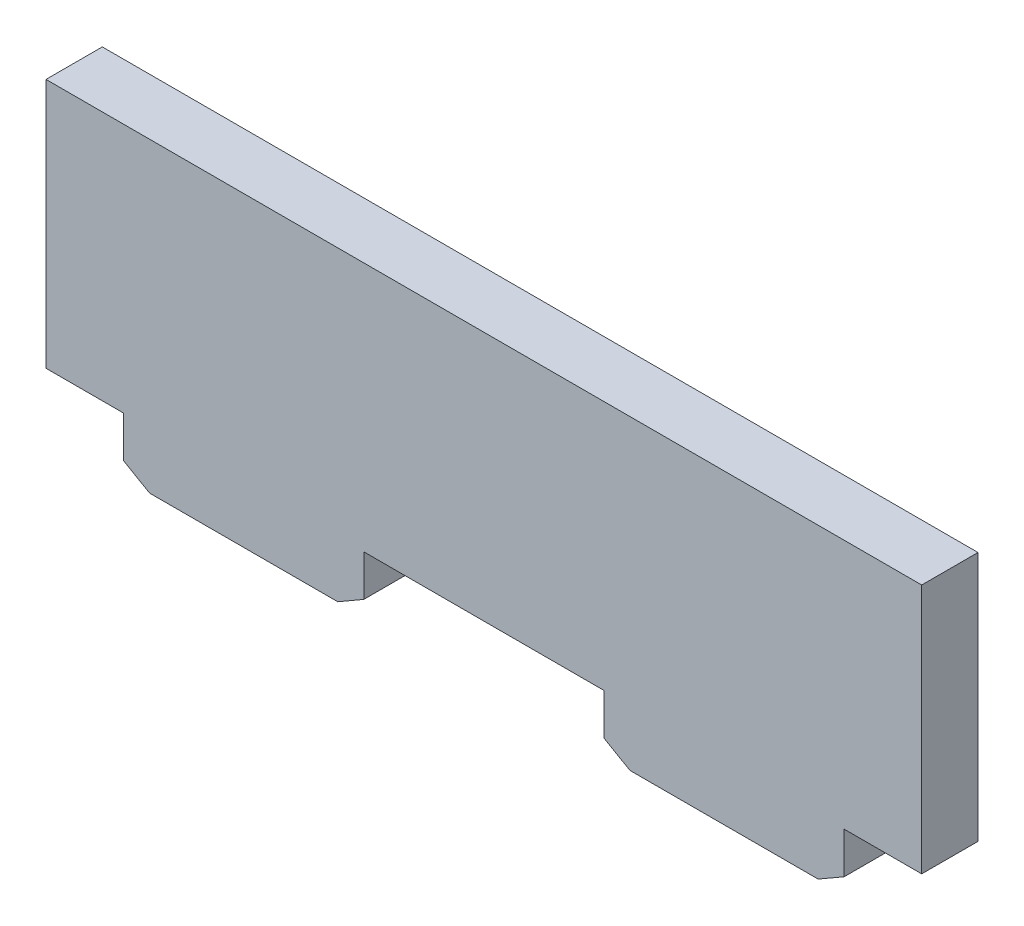
ISO-10303-21;
HEADER;
FILE_DESCRIPTION(('STEP AP214'),'2;1');
FILE_NAME('part.step','',(''),(''),'','','');
FILE_SCHEMA(('AUTOMOTIVE_DESIGN { 1 0 10303 214 1 1 1 1 }'));
ENDSEC;
DATA;
#1=APPLICATION_CONTEXT('core data for automotive mechanical design processes');
#2=APPLICATION_PROTOCOL_DEFINITION('international standard','automotive_design',2000,#1);
#3=PRODUCT_CONTEXT('',#1,'mechanical');
#4=PRODUCT('Part','Part','',(#3));
#5=PRODUCT_RELATED_PRODUCT_CATEGORY('part','',(#4));
#6=PRODUCT_DEFINITION_FORMATION('','',#4);
#7=PRODUCT_DEFINITION_CONTEXT('part definition',#1,'design');
#8=PRODUCT_DEFINITION('design','',#6,#7);
#9=PRODUCT_DEFINITION_SHAPE('','',#8);
#10=(LENGTH_UNIT() NAMED_UNIT(*) SI_UNIT(.MILLI.,.METRE.));
#11=(NAMED_UNIT(*) PLANE_ANGLE_UNIT() SI_UNIT($,.RADIAN.));
#12=(NAMED_UNIT(*) SI_UNIT($,.STERADIAN.) SOLID_ANGLE_UNIT());
#13=UNCERTAINTY_MEASURE_WITH_UNIT(LENGTH_MEASURE(1.E-05),#10,'distance_accuracy_value','');
#14=(GEOMETRIC_REPRESENTATION_CONTEXT(3) GLOBAL_UNCERTAINTY_ASSIGNED_CONTEXT((#13)) GLOBAL_UNIT_ASSIGNED_CONTEXT((#10,
#11,#12)) REPRESENTATION_CONTEXT('',''));
#15=CARTESIAN_POINT('',(0.,0.,0.));
#16=DIRECTION('',(0.,0.,1.));
#17=DIRECTION('',(1.,0.,0.));
#18=AXIS2_PLACEMENT_3D('',#15,#16,#17);
#19=CARTESIAN_POINT('',(-22.225,-6.35,2.8575));
#20=DIRECTION('',(0.,1.,0.));
#21=DIRECTION('',(0.,0.,1.));
#22=AXIS2_PLACEMENT_3D('',#19,#20,#21);
#23=PLANE('',#22);
#24=DIRECTION('',(0.,0.,1.));
#25=VECTOR('',#24,1.);
#26=CARTESIAN_POINT('',(18.288,-6.35,2.8575));
#27=LINE('',#26,#25);
#28=CARTESIAN_POINT('',(18.288,-6.35,0.));
#29=VERTEX_POINT('',#28);
#30=CARTESIAN_POINT('',(18.288,-6.35,2.8575));
#31=VERTEX_POINT('',#30);
#32=EDGE_CURVE('E161',#29,#31,#27,.T.);
#33=ORIENTED_EDGE('',*,*,#32,.F.);
#34=DIRECTION('',(1.,0.,0.));
#35=VECTOR('',#34,1.);
#36=CARTESIAN_POINT('',(-22.225,-6.35,0.));
#37=LINE('',#36,#35);
#38=CARTESIAN_POINT('',(22.225,-6.35,0.));
#39=VERTEX_POINT('',#38);
#40=EDGE_CURVE('E170',#29,#39,#37,.T.);
#41=ORIENTED_EDGE('',*,*,#40,.T.);
#42=DIRECTION('',(0.,0.,-1.));
#43=VECTOR('',#42,1.);
#44=CARTESIAN_POINT('',(22.225,-6.35,2.8575));
#45=LINE('',#44,#43);
#46=CARTESIAN_POINT('',(22.225,-6.35,2.8575));
#47=VERTEX_POINT('',#46);
#48=EDGE_CURVE('E242',#47,#39,#45,.T.);
#49=ORIENTED_EDGE('',*,*,#48,.F.);
#50=DIRECTION('',(1.,0.,0.));
#51=VECTOR('',#50,1.);
#52=CARTESIAN_POINT('',(-22.225,-6.35,2.8575));
#53=LINE('',#52,#51);
#54=EDGE_CURVE('E183',#31,#47,#53,.T.);
#55=ORIENTED_EDGE('',*,*,#54,.F.);
#56=EDGE_LOOP('',(#33,#41,#49,#55));
#57=FACE_BOUND('',#56,.T.);
#58=ADVANCED_FACE('F41',(#57),#23,.F.);
#59=DIRECTION('',(0.,0.,-1.));
#60=VECTOR('',#59,1.);
#61=CARTESIAN_POINT('',(6.096,-6.35,2.8575));
#62=LINE('',#61,#60);
#63=CARTESIAN_POINT('',(6.096,-6.35,2.8575));
#64=VERTEX_POINT('',#63);
#65=CARTESIAN_POINT('',(6.096,-6.35,0.));
#66=VERTEX_POINT('',#65);
#67=EDGE_CURVE('E185',#64,#66,#62,.T.);
#68=ORIENTED_EDGE('',*,*,#67,.F.);
#69=CARTESIAN_POINT('',(-6.096,-6.35,2.8575));
#70=VERTEX_POINT('',#69);
#71=EDGE_CURVE('E243',#70,#64,#53,.T.);
#72=ORIENTED_EDGE('',*,*,#71,.F.);
#73=DIRECTION('',(0.,0.,1.));
#74=VECTOR('',#73,1.);
#75=CARTESIAN_POINT('',(-6.096,-6.35,2.8575));
#76=LINE('',#75,#74);
#77=CARTESIAN_POINT('',(-6.096,-6.35,0.));
#78=VERTEX_POINT('',#77);
#79=EDGE_CURVE('E202',#78,#70,#76,.T.);
#80=ORIENTED_EDGE('',*,*,#79,.F.);
#81=EDGE_CURVE('E178',#78,#66,#37,.T.);
#82=ORIENTED_EDGE('',*,*,#81,.T.);
#83=EDGE_LOOP('',(#68,#72,#80,#82));
#84=FACE_BOUND('',#83,.T.);
#85=ADVANCED_FACE('F356',(#84),#23,.F.);
#86=DIRECTION('',(0.,0.,-1.));
#87=VECTOR('',#86,1.);
#88=CARTESIAN_POINT('',(-18.288,-6.35,2.8575));
#89=LINE('',#88,#87);
#90=CARTESIAN_POINT('',(-18.288,-6.35,2.8575));
#91=VERTEX_POINT('',#90);
#92=CARTESIAN_POINT('',(-18.288,-6.35,0.));
#93=VERTEX_POINT('',#92);
#94=EDGE_CURVE('E207',#91,#93,#89,.T.);
#95=ORIENTED_EDGE('',*,*,#94,.F.);
#96=CARTESIAN_POINT('',(-22.225,-6.35,2.8575));
#97=VERTEX_POINT('',#96);
#98=EDGE_CURVE('E238',#97,#91,#53,.T.);
#99=ORIENTED_EDGE('',*,*,#98,.F.);
#100=DIRECTION('',(0.,0.,-1.));
#101=VECTOR('',#100,1.);
#102=CARTESIAN_POINT('',(-22.225,-6.35,2.8575));
#103=LINE('',#102,#101);
#104=CARTESIAN_POINT('',(-22.225,-6.35,0.));
#105=VERTEX_POINT('',#104);
#106=EDGE_CURVE('E255',#97,#105,#103,.T.);
#107=ORIENTED_EDGE('',*,*,#106,.T.);
#108=EDGE_CURVE('E181',#105,#93,#37,.T.);
#109=ORIENTED_EDGE('',*,*,#108,.T.);
#110=EDGE_LOOP('',(#95,#99,#107,#109));
#111=FACE_BOUND('',#110,.T.);
#112=ADVANCED_FACE('F334',(#111),#23,.F.);
#113=CARTESIAN_POINT('',(22.225,6.35,2.8575));
#114=DIRECTION('',(-1.,0.,0.));
#115=DIRECTION('',(0.,0.,1.));
#116=AXIS2_PLACEMENT_3D('',#113,#114,#115);
#117=PLANE('',#116);
#118=DIRECTION('',(0.,1.,0.));
#119=VECTOR('',#118,1.);
#120=CARTESIAN_POINT('',(22.225,6.35,0.));
#121=LINE('',#120,#119);
#122=CARTESIAN_POINT('',(22.225,6.35,0.));
#123=VERTEX_POINT('',#122);
#124=EDGE_CURVE('E173',#39,#123,#121,.T.);
#125=ORIENTED_EDGE('',*,*,#124,.T.);
#126=DIRECTION('',(0.,0.,-1.));
#127=VECTOR('',#126,1.);
#128=CARTESIAN_POINT('',(22.225,6.35,2.8575));
#129=LINE('',#128,#127);
#130=CARTESIAN_POINT('',(22.225,6.35,2.8575));
#131=VERTEX_POINT('',#130);
#132=EDGE_CURVE('E263',#131,#123,#129,.T.);
#133=ORIENTED_EDGE('',*,*,#132,.F.);
#134=DIRECTION('',(0.,1.,0.));
#135=VECTOR('',#134,1.);
#136=CARTESIAN_POINT('',(22.225,6.35,2.8575));
#137=LINE('',#136,#135);
#138=EDGE_CURVE('E228',#47,#131,#137,.T.);
#139=ORIENTED_EDGE('',*,*,#138,.F.);
#140=ORIENTED_EDGE('',*,*,#48,.T.);
#141=EDGE_LOOP('',(#125,#133,#139,#140));
#142=FACE_BOUND('',#141,.T.);
#143=ADVANCED_FACE('F346',(#142),#117,.F.);
#144=CARTESIAN_POINT('',(-22.225,6.35,2.8575));
#145=DIRECTION('',(0.,-1.,0.));
#146=DIRECTION('',(0.,0.,-1.));
#147=AXIS2_PLACEMENT_3D('',#144,#145,#146);
#148=PLANE('',#147);
#149=DIRECTION('',(-1.,0.,0.));
#150=VECTOR('',#149,1.);
#151=CARTESIAN_POINT('',(-22.225,6.35,0.));
#152=LINE('',#151,#150);
#153=CARTESIAN_POINT('',(-22.225,6.35,0.));
#154=VERTEX_POINT('',#153);
#155=EDGE_CURVE('E246',#123,#154,#152,.T.);
#156=ORIENTED_EDGE('',*,*,#155,.T.);
#157=DIRECTION('',(0.,0.,-1.));
#158=VECTOR('',#157,1.);
#159=CARTESIAN_POINT('',(-22.225,6.35,2.8575));
#160=LINE('',#159,#158);
#161=CARTESIAN_POINT('',(-22.225,6.35,2.8575));
#162=VERTEX_POINT('',#161);
#163=EDGE_CURVE('E259',#162,#154,#160,.T.);
#164=ORIENTED_EDGE('',*,*,#163,.F.);
#165=DIRECTION('',(-1.,0.,0.));
#166=VECTOR('',#165,1.);
#167=CARTESIAN_POINT('',(-22.225,6.35,2.8575));
#168=LINE('',#167,#166);
#169=EDGE_CURVE('E232',#131,#162,#168,.T.);
#170=ORIENTED_EDGE('',*,*,#169,.F.);
#171=ORIENTED_EDGE('',*,*,#132,.T.);
#172=EDGE_LOOP('',(#156,#164,#170,#171));
#173=FACE_BOUND('',#172,.T.);
#174=ADVANCED_FACE('F343',(#173),#148,.F.);
#175=CARTESIAN_POINT('',(-22.225,6.35,2.8575));
#176=DIRECTION('',(1.,0.,0.));
#177=DIRECTION('',(0.,1.,0.));
#178=AXIS2_PLACEMENT_3D('',#175,#176,#177);
#179=PLANE('',#178);
#180=DIRECTION('',(0.,-1.,0.));
#181=VECTOR('',#180,1.);
#182=CARTESIAN_POINT('',(-22.225,6.35,0.));
#183=LINE('',#182,#181);
#184=EDGE_CURVE('E179',#154,#105,#183,.T.);
#185=ORIENTED_EDGE('',*,*,#184,.T.);
#186=ORIENTED_EDGE('',*,*,#106,.F.);
#187=DIRECTION('',(0.,-1.,0.));
#188=VECTOR('',#187,1.);
#189=CARTESIAN_POINT('',(-22.225,6.35,2.8575));
#190=LINE('',#189,#188);
#191=EDGE_CURVE('E235',#162,#97,#190,.T.);
#192=ORIENTED_EDGE('',*,*,#191,.F.);
#193=ORIENTED_EDGE('',*,*,#163,.T.);
#194=EDGE_LOOP('',(#185,#186,#192,#193));
#195=FACE_BOUND('',#194,.T.);
#196=ADVANCED_FACE('F339',(#195),#179,.F.);
#197=CARTESIAN_POINT('',(0.,0.,2.8575));
#198=DIRECTION('',(0.,0.,1.));
#199=DIRECTION('',(1.,0.,0.));
#200=AXIS2_PLACEMENT_3D('',#197,#198,#199);
#201=PLANE('',#200);
#202=DIRECTION('',(-1.,0.,0.));
#203=VECTOR('',#202,1.);
#204=CARTESIAN_POINT('',(6.096,-9.2075,2.8575));
#205=LINE('',#204,#203);
#206=CARTESIAN_POINT('',(16.9681772846325,-9.2075,2.8575));
#207=VERTEX_POINT('',#206);
#208=CARTESIAN_POINT('',(7.41582271536749,-9.2075,2.8575));
#209=VERTEX_POINT('',#208);
#210=EDGE_CURVE('E189',#207,#209,#205,.T.);
#211=ORIENTED_EDGE('',*,*,#210,.F.);
#212=DIRECTION('',(0.866025403784437,0.500000000000003,0.));
#213=VECTOR('',#212,1.);
#214=CARTESIAN_POINT('',(8.2290087738308,-14.2530612922049,2.8575));
#215=LINE('',#214,#213);
#216=CARTESIAN_POINT('',(18.288,-8.4455,2.8575));
#217=VERTEX_POINT('',#216);
#218=EDGE_CURVE('E302',#207,#217,#215,.T.);
#219=ORIENTED_EDGE('',*,*,#218,.T.);
#220=DIRECTION('',(0.,1.,0.));
#221=VECTOR('',#220,1.);
#222=CARTESIAN_POINT('',(18.288,-9.2075,2.8575));
#223=LINE('',#222,#221);
#224=EDGE_CURVE('E199',#217,#31,#223,.T.);
#225=ORIENTED_EDGE('',*,*,#224,.T.);
#226=ORIENTED_EDGE('',*,*,#54,.T.);
#227=ORIENTED_EDGE('',*,*,#138,.T.);
#228=ORIENTED_EDGE('',*,*,#169,.T.);
#229=ORIENTED_EDGE('',*,*,#191,.T.);
#230=ORIENTED_EDGE('',*,*,#98,.T.);
#231=DIRECTION('',(0.,1.,0.));
#232=VECTOR('',#231,1.);
#233=CARTESIAN_POINT('',(-18.288,-9.2075,2.8575));
#234=LINE('',#233,#232);
#235=CARTESIAN_POINT('',(-18.288,-8.4455,2.8575));
#236=VERTEX_POINT('',#235);
#237=EDGE_CURVE('E222',#236,#91,#234,.T.);
#238=ORIENTED_EDGE('',*,*,#237,.F.);
#239=DIRECTION('',(0.866025403784437,-0.500000000000003,0.));
#240=VECTOR('',#239,1.);
#241=CARTESIAN_POINT('',(-8.2290087738308,-14.2530612922049,2.8575));
#242=LINE('',#241,#240);
#243=CARTESIAN_POINT('',(-16.9681772846325,-9.2075,2.8575));
#244=VERTEX_POINT('',#243);
#245=EDGE_CURVE('E280',#236,#244,#242,.T.);
#246=ORIENTED_EDGE('',*,*,#245,.T.);
#247=DIRECTION('',(-1.,0.,0.));
#248=VECTOR('',#247,1.);
#249=CARTESIAN_POINT('',(-18.288,-9.2075,2.8575));
#250=LINE('',#249,#248);
#251=CARTESIAN_POINT('',(-7.41582271536749,-9.2075,2.8575));
#252=VERTEX_POINT('',#251);
#253=EDGE_CURVE('E203',#252,#244,#250,.T.);
#254=ORIENTED_EDGE('',*,*,#253,.F.);
#255=DIRECTION('',(0.866025403784439,0.499999999999999,0.));
#256=VECTOR('',#255,1.);
#257=CARTESIAN_POINT('',(2.13300877383074,-3.69447956926504,2.8575));
#258=LINE('',#257,#256);
#259=CARTESIAN_POINT('',(-6.096,-8.4455,2.8575));
#260=VERTEX_POINT('',#259);
#261=EDGE_CURVE('E299',#252,#260,#258,.T.);
#262=ORIENTED_EDGE('',*,*,#261,.T.);
#263=DIRECTION('',(0.,1.,0.));
#264=VECTOR('',#263,1.);
#265=CARTESIAN_POINT('',(-6.096,-9.2075,2.8575));
#266=LINE('',#265,#264);
#267=EDGE_CURVE('E225',#260,#70,#266,.T.);
#268=ORIENTED_EDGE('',*,*,#267,.T.);
#269=ORIENTED_EDGE('',*,*,#71,.T.);
#270=DIRECTION('',(0.,1.,0.));
#271=VECTOR('',#270,1.);
#272=CARTESIAN_POINT('',(6.096,-9.2075,2.8575));
#273=LINE('',#272,#271);
#274=CARTESIAN_POINT('',(6.096,-8.4455,2.8575));
#275=VERTEX_POINT('',#274);
#276=EDGE_CURVE('E196',#275,#64,#273,.T.);
#277=ORIENTED_EDGE('',*,*,#276,.F.);
#278=DIRECTION('',(0.866025403784439,-0.499999999999999,0.));
#279=VECTOR('',#278,1.);
#280=CARTESIAN_POINT('',(-2.13300877383074,-3.69447956926504,2.8575));
#281=LINE('',#280,#279);
#282=EDGE_CURVE('E284',#275,#209,#281,.T.);
#283=ORIENTED_EDGE('',*,*,#282,.T.);
#284=EDGE_LOOP('',(#211,#219,#225,#226,#227,#228,#229,#230,#238,#246,#254,#262,#268,#269,#277,#283));
#285=FACE_BOUND('',#284,.T.);
#286=ADVANCED_FACE('F320',(#285),#201,.T.);
#287=CARTESIAN_POINT('',(0.,0.,0.));
#288=DIRECTION('',(0.,0.,1.));
#289=DIRECTION('',(1.,0.,0.));
#290=AXIS2_PLACEMENT_3D('',#287,#288,#289);
#291=PLANE('',#290);
#292=DIRECTION('',(0.,1.,0.));
#293=VECTOR('',#292,1.);
#294=CARTESIAN_POINT('',(18.288,-9.2075,0.));
#295=LINE('',#294,#293);
#296=CARTESIAN_POINT('',(18.288,-8.4455,0.));
#297=VERTEX_POINT('',#296);
#298=EDGE_CURVE('E156',#297,#29,#295,.T.);
#299=ORIENTED_EDGE('',*,*,#298,.F.);
#300=DIRECTION('',(-0.866025403784437,-0.500000000000003,0.));
#301=VECTOR('',#300,1.);
#302=CARTESIAN_POINT('',(16.9681772846325,-9.2075,0.));
#303=LINE('',#302,#301);
#304=CARTESIAN_POINT('',(16.9681772846325,-9.2075,0.));
#305=VERTEX_POINT('',#304);
#306=EDGE_CURVE('E309',#297,#305,#303,.T.);
#307=ORIENTED_EDGE('',*,*,#306,.T.);
#308=DIRECTION('',(1.,0.,0.));
#309=VECTOR('',#308,1.);
#310=CARTESIAN_POINT('',(6.096,-9.2075,0.));
#311=LINE('',#310,#309);
#312=CARTESIAN_POINT('',(7.41582271536749,-9.2075,0.));
#313=VERTEX_POINT('',#312);
#314=EDGE_CURVE('E167',#313,#305,#311,.T.);
#315=ORIENTED_EDGE('',*,*,#314,.F.);
#316=DIRECTION('',(-0.866025403784439,0.499999999999999,0.));
#317=VECTOR('',#316,1.);
#318=CARTESIAN_POINT('',(7.41582271536749,-9.2075,0.));
#319=LINE('',#318,#317);
#320=CARTESIAN_POINT('',(6.096,-8.4455,0.));
#321=VERTEX_POINT('',#320);
#322=EDGE_CURVE('E274',#313,#321,#319,.T.);
#323=ORIENTED_EDGE('',*,*,#322,.T.);
#324=DIRECTION('',(0.,1.,0.));
#325=VECTOR('',#324,1.);
#326=CARTESIAN_POINT('',(6.096,-9.2075,0.));
#327=LINE('',#326,#325);
#328=EDGE_CURVE('E166',#321,#66,#327,.T.);
#329=ORIENTED_EDGE('',*,*,#328,.T.);
#330=ORIENTED_EDGE('',*,*,#81,.F.);
#331=DIRECTION('',(0.,1.,0.));
#332=VECTOR('',#331,1.);
#333=CARTESIAN_POINT('',(-6.096,-9.2075,0.));
#334=LINE('',#333,#332);
#335=CARTESIAN_POINT('',(-6.096,-8.4455,0.));
#336=VERTEX_POINT('',#335);
#337=EDGE_CURVE('E210',#336,#78,#334,.T.);
#338=ORIENTED_EDGE('',*,*,#337,.F.);
#339=DIRECTION('',(-0.866025403784439,-0.499999999999999,0.));
#340=VECTOR('',#339,1.);
#341=CARTESIAN_POINT('',(-7.41582271536749,-9.2075,0.));
#342=LINE('',#341,#340);
#343=CARTESIAN_POINT('',(-7.41582271536749,-9.2075,0.));
#344=VERTEX_POINT('',#343);
#345=EDGE_CURVE('E58',#336,#344,#342,.T.);
#346=ORIENTED_EDGE('',*,*,#345,.T.);
#347=DIRECTION('',(1.,0.,0.));
#348=VECTOR('',#347,1.);
#349=CARTESIAN_POINT('',(-18.288,-9.2075,0.));
#350=LINE('',#349,#348);
#351=CARTESIAN_POINT('',(-16.9681772846325,-9.2075,0.));
#352=VERTEX_POINT('',#351);
#353=EDGE_CURVE('E206',#352,#344,#350,.T.);
#354=ORIENTED_EDGE('',*,*,#353,.F.);
#355=DIRECTION('',(-0.866025403784437,0.500000000000003,0.));
#356=VECTOR('',#355,1.);
#357=CARTESIAN_POINT('',(-16.9681772846325,-9.2075,0.));
#358=LINE('',#357,#356);
#359=CARTESIAN_POINT('',(-18.288,-8.4455,0.));
#360=VERTEX_POINT('',#359);
#361=EDGE_CURVE('E271',#352,#360,#358,.T.);
#362=ORIENTED_EDGE('',*,*,#361,.T.);
#363=DIRECTION('',(0.,1.,0.));
#364=VECTOR('',#363,1.);
#365=CARTESIAN_POINT('',(-18.288,-9.2075,0.));
#366=LINE('',#365,#364);
#367=EDGE_CURVE('E219',#360,#93,#366,.T.);
#368=ORIENTED_EDGE('',*,*,#367,.T.);
#369=ORIENTED_EDGE('',*,*,#108,.F.);
#370=ORIENTED_EDGE('',*,*,#184,.F.);
#371=ORIENTED_EDGE('',*,*,#155,.F.);
#372=ORIENTED_EDGE('',*,*,#124,.F.);
#373=ORIENTED_EDGE('',*,*,#40,.F.);
#374=EDGE_LOOP('',(#299,#307,#315,#323,#329,#330,#338,#346,#354,#362,#368,#369,#370,#371,#372,#373));
#375=FACE_BOUND('',#374,.T.);
#376=ADVANCED_FACE('F171',(#375),#291,.F.);
#377=CARTESIAN_POINT('',(-6.096,-9.2075,2.8575));
#378=DIRECTION('',(-1.,0.,0.));
#379=DIRECTION('',(0.,0.,1.));
#380=AXIS2_PLACEMENT_3D('',#377,#378,#379);
#381=PLANE('',#380);
#382=ORIENTED_EDGE('',*,*,#267,.F.);
#383=DIRECTION('',(0.,0.,-1.));
#384=VECTOR('',#383,1.);
#385=CARTESIAN_POINT('',(-6.096,-8.4455,0.));
#386=LINE('',#385,#384);
#387=EDGE_CURVE('E11',#260,#336,#386,.T.);
#388=ORIENTED_EDGE('',*,*,#387,.T.);
#389=ORIENTED_EDGE('',*,*,#337,.T.);
#390=ORIENTED_EDGE('',*,*,#79,.T.);
#391=EDGE_LOOP('',(#382,#388,#389,#390));
#392=FACE_BOUND('',#391,.T.);
#393=ADVANCED_FACE('F359',(#392),#381,.F.);
#394=CARTESIAN_POINT('',(-18.288,-9.2075,2.8575));
#395=DIRECTION('',(1.,0.,0.));
#396=DIRECTION('',(0.,0.,-1.));
#397=AXIS2_PLACEMENT_3D('',#394,#395,#396);
#398=PLANE('',#397);
#399=ORIENTED_EDGE('',*,*,#367,.F.);
#400=DIRECTION('',(0.,0.,1.));
#401=VECTOR('',#400,1.);
#402=CARTESIAN_POINT('',(-18.288,-8.4455,2.8575));
#403=LINE('',#402,#401);
#404=EDGE_CURVE('E292',#360,#236,#403,.T.);
#405=ORIENTED_EDGE('',*,*,#404,.T.);
#406=ORIENTED_EDGE('',*,*,#237,.T.);
#407=ORIENTED_EDGE('',*,*,#94,.T.);
#408=EDGE_LOOP('',(#399,#405,#406,#407));
#409=FACE_BOUND('',#408,.T.);
#410=ADVANCED_FACE('F330',(#409),#398,.F.);
#411=CARTESIAN_POINT('',(0.,-9.2075,0.));
#412=DIRECTION('',(0.,-1.,0.));
#413=DIRECTION('',(0.,0.,-1.));
#414=AXIS2_PLACEMENT_3D('',#411,#412,#413);
#415=PLANE('',#414);
#416=ORIENTED_EDGE('',*,*,#353,.T.);
#417=DIRECTION('',(0.,0.,1.));
#418=VECTOR('',#417,1.);
#419=CARTESIAN_POINT('',(-7.41582271536749,-9.2075,2.8575));
#420=LINE('',#419,#418);
#421=EDGE_CURVE('E51',#344,#252,#420,.T.);
#422=ORIENTED_EDGE('',*,*,#421,.T.);
#423=ORIENTED_EDGE('',*,*,#253,.T.);
#424=DIRECTION('',(0.,0.,-1.));
#425=VECTOR('',#424,1.);
#426=CARTESIAN_POINT('',(-16.9681772846325,-9.2075,0.));
#427=LINE('',#426,#425);
#428=EDGE_CURVE('E288',#244,#352,#427,.T.);
#429=ORIENTED_EDGE('',*,*,#428,.T.);
#430=EDGE_LOOP('',(#416,#422,#423,#429));
#431=FACE_BOUND('',#430,.T.);
#432=ADVANCED_FACE('F316',(#431),#415,.T.);
#433=CARTESIAN_POINT('',(18.288,-9.2075,2.8575));
#434=DIRECTION('',(-1.,0.,0.));
#435=DIRECTION('',(0.,0.,1.));
#436=AXIS2_PLACEMENT_3D('',#433,#434,#435);
#437=PLANE('',#436);
#438=ORIENTED_EDGE('',*,*,#224,.F.);
#439=DIRECTION('',(0.,0.,-1.));
#440=VECTOR('',#439,1.);
#441=CARTESIAN_POINT('',(18.288,-8.4455,0.));
#442=LINE('',#441,#440);
#443=EDGE_CURVE('E163',#217,#297,#442,.T.);
#444=ORIENTED_EDGE('',*,*,#443,.T.);
#445=ORIENTED_EDGE('',*,*,#298,.T.);
#446=ORIENTED_EDGE('',*,*,#32,.T.);
#447=EDGE_LOOP('',(#438,#444,#445,#446));
#448=FACE_BOUND('',#447,.T.);
#449=ADVANCED_FACE('F159',(#448),#437,.F.);
#450=CARTESIAN_POINT('',(6.096,-9.2075,2.8575));
#451=DIRECTION('',(1.,0.,0.));
#452=DIRECTION('',(0.,0.,-1.));
#453=AXIS2_PLACEMENT_3D('',#450,#451,#452);
#454=PLANE('',#453);
#455=ORIENTED_EDGE('',*,*,#328,.F.);
#456=DIRECTION('',(0.,0.,1.));
#457=VECTOR('',#456,1.);
#458=CARTESIAN_POINT('',(6.096,-8.4455,2.8575));
#459=LINE('',#458,#457);
#460=EDGE_CURVE('E277',#321,#275,#459,.T.);
#461=ORIENTED_EDGE('',*,*,#460,.T.);
#462=ORIENTED_EDGE('',*,*,#276,.T.);
#463=ORIENTED_EDGE('',*,*,#67,.T.);
#464=EDGE_LOOP('',(#455,#461,#462,#463));
#465=FACE_BOUND('',#464,.T.);
#466=ADVANCED_FACE('F422',(#465),#454,.F.);
#467=CARTESIAN_POINT('',(0.,-9.2075,0.));
#468=DIRECTION('',(0.,-1.,0.));
#469=DIRECTION('',(0.,0.,-1.));
#470=AXIS2_PLACEMENT_3D('',#467,#468,#469);
#471=PLANE('',#470);
#472=ORIENTED_EDGE('',*,*,#314,.T.);
#473=DIRECTION('',(0.,0.,1.));
#474=VECTOR('',#473,1.);
#475=CARTESIAN_POINT('',(16.9681772846325,-9.2075,2.8575));
#476=LINE('',#475,#474);
#477=EDGE_CURVE('E295',#305,#207,#476,.T.);
#478=ORIENTED_EDGE('',*,*,#477,.T.);
#479=ORIENTED_EDGE('',*,*,#210,.T.);
#480=DIRECTION('',(0.,0.,-1.));
#481=VECTOR('',#480,1.);
#482=CARTESIAN_POINT('',(7.41582271536749,-9.2075,0.));
#483=LINE('',#482,#481);
#484=EDGE_CURVE('E267',#209,#313,#483,.T.);
#485=ORIENTED_EDGE('',*,*,#484,.T.);
#486=EDGE_LOOP('',(#472,#478,#479,#485));
#487=FACE_BOUND('',#486,.T.);
#488=ADVANCED_FACE('F390',(#487),#471,.T.);
#489=CARTESIAN_POINT('',(7.41582271536749,-9.2075,0.));
#490=DIRECTION('',(-0.499999999999999,-0.866025403784439,0.));
#491=DIRECTION('',(0.,0.,1.));
#492=AXIS2_PLACEMENT_3D('',#489,#490,#491);
#493=PLANE('',#492);
#494=ORIENTED_EDGE('',*,*,#282,.F.);
#495=ORIENTED_EDGE('',*,*,#460,.F.);
#496=ORIENTED_EDGE('',*,*,#322,.F.);
#497=ORIENTED_EDGE('',*,*,#484,.F.);
#498=EDGE_LOOP('',(#494,#495,#496,#497));
#499=FACE_BOUND('',#498,.T.);
#500=ADVANCED_FACE('F384',(#499),#493,.T.);
#501=CARTESIAN_POINT('',(-16.9681772846325,-9.2075,0.));
#502=DIRECTION('',(-0.500000000000003,-0.866025403784437,0.));
#503=DIRECTION('',(0.,0.,1.));
#504=AXIS2_PLACEMENT_3D('',#501,#502,#503);
#505=PLANE('',#504);
#506=ORIENTED_EDGE('',*,*,#245,.F.);
#507=ORIENTED_EDGE('',*,*,#404,.F.);
#508=ORIENTED_EDGE('',*,*,#361,.F.);
#509=ORIENTED_EDGE('',*,*,#428,.F.);
#510=EDGE_LOOP('',(#506,#507,#508,#509));
#511=FACE_BOUND('',#510,.T.);
#512=ADVANCED_FACE('F326',(#511),#505,.T.);
#513=CARTESIAN_POINT('',(16.9681772846325,-9.2075,0.));
#514=DIRECTION('',(0.500000000000003,-0.866025403784437,0.));
#515=DIRECTION('',(0.,0.,-1.));
#516=AXIS2_PLACEMENT_3D('',#513,#514,#515);
#517=PLANE('',#516);
#518=ORIENTED_EDGE('',*,*,#306,.F.);
#519=ORIENTED_EDGE('',*,*,#443,.F.);
#520=ORIENTED_EDGE('',*,*,#218,.F.);
#521=ORIENTED_EDGE('',*,*,#477,.F.);
#522=EDGE_LOOP('',(#518,#519,#520,#521));
#523=FACE_BOUND('',#522,.T.);
#524=ADVANCED_FACE('F361',(#523),#517,.T.);
#525=CARTESIAN_POINT('',(-7.41582271536749,-9.2075,0.));
#526=DIRECTION('',(0.499999999999999,-0.866025403784439,0.));
#527=DIRECTION('',(0.,0.,-1.));
#528=AXIS2_PLACEMENT_3D('',#525,#526,#527);
#529=PLANE('',#528);
#530=ORIENTED_EDGE('',*,*,#345,.F.);
#531=ORIENTED_EDGE('',*,*,#387,.F.);
#532=ORIENTED_EDGE('',*,*,#261,.F.);
#533=ORIENTED_EDGE('',*,*,#421,.F.);
#534=EDGE_LOOP('',(#530,#531,#532,#533));
#535=FACE_BOUND('',#534,.T.);
#536=ADVANCED_FACE('F44',(#535),#529,.T.);
#537=CLOSED_SHELL('',(#58,#85,#112,#143,#174,#196,#286,#376,#393,#410,#432,#449,#466,#488,#500,
#512,#524,#536));
#538=MANIFOLD_SOLID_BREP('B2',#537);
#539=ADVANCED_BREP_SHAPE_REPRESENTATION('',(#18,#538),#14);
#540=SHAPE_DEFINITION_REPRESENTATION(#9,#539);
ENDSEC;
END-ISO-10303-21;
